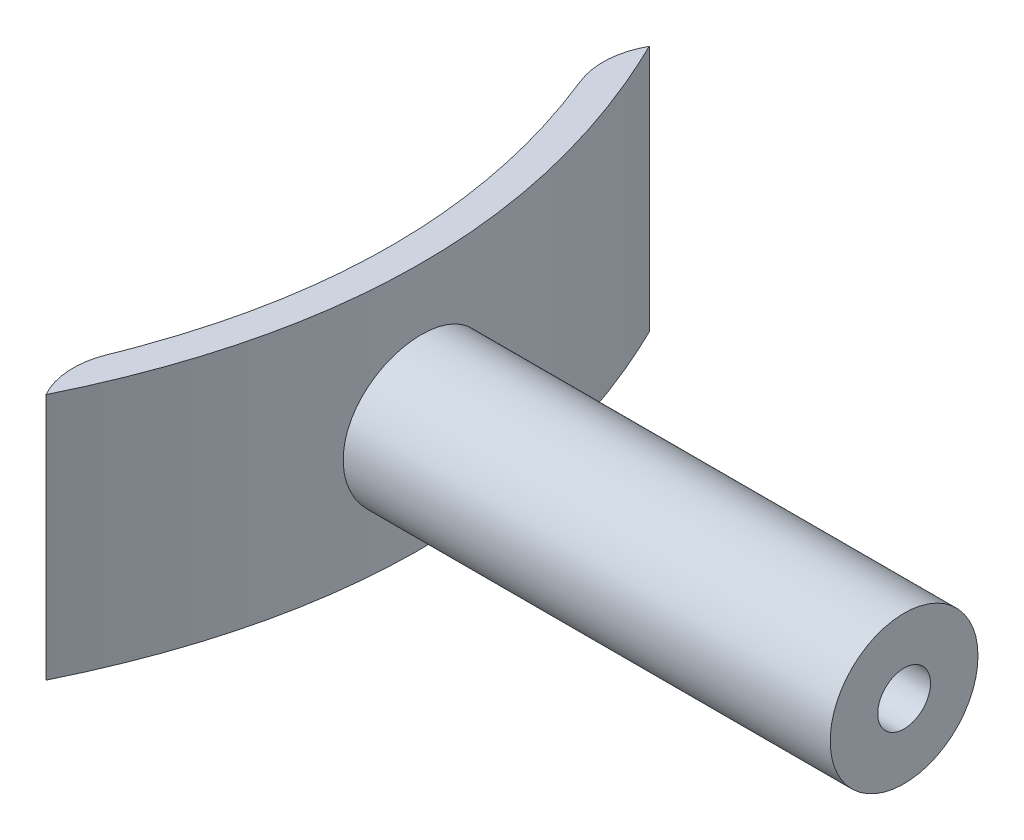
ISO-10303-21;
HEADER;
FILE_DESCRIPTION(('STEP AP214'),'2;1');
FILE_NAME('part.step','',(''),(''),'','','');
FILE_SCHEMA(('AUTOMOTIVE_DESIGN { 1 0 10303 214 1 1 1 1 }'));
ENDSEC;
DATA;
#1=APPLICATION_CONTEXT('core data for automotive mechanical design processes');
#2=APPLICATION_PROTOCOL_DEFINITION('international standard','automotive_design',2000,#1);
#3=PRODUCT_CONTEXT('',#1,'mechanical');
#4=PRODUCT('Part','Part','',(#3));
#5=PRODUCT_RELATED_PRODUCT_CATEGORY('part','',(#4));
#6=PRODUCT_DEFINITION_FORMATION('','',#4);
#7=PRODUCT_DEFINITION_CONTEXT('part definition',#1,'design');
#8=PRODUCT_DEFINITION('design','',#6,#7);
#9=PRODUCT_DEFINITION_SHAPE('','',#8);
#10=(LENGTH_UNIT() NAMED_UNIT(*) SI_UNIT(.MILLI.,.METRE.));
#11=(NAMED_UNIT(*) PLANE_ANGLE_UNIT() SI_UNIT($,.RADIAN.));
#12=(NAMED_UNIT(*) SI_UNIT($,.STERADIAN.) SOLID_ANGLE_UNIT());
#13=UNCERTAINTY_MEASURE_WITH_UNIT(LENGTH_MEASURE(1.E-05),#10,'distance_accuracy_value','');
#14=(GEOMETRIC_REPRESENTATION_CONTEXT(3) GLOBAL_UNCERTAINTY_ASSIGNED_CONTEXT((#13)) GLOBAL_UNIT_ASSIGNED_CONTEXT((#10,
#11,#12)) REPRESENTATION_CONTEXT('',''));
#15=CARTESIAN_POINT('',(0.,0.,0.));
#16=DIRECTION('',(0.,0.,1.));
#17=DIRECTION('',(1.,0.,0.));
#18=AXIS2_PLACEMENT_3D('',#15,#16,#17);
#19=CARTESIAN_POINT('',(8.30578993953427,18.,-19.120521249849));
#20=CARTESIAN_POINT('',(8.69432640668797,18.,-18.3272698292218));
#21=CARTESIAN_POINT('',(9.43893120807307,18.,-16.7065871316813));
#22=CARTESIAN_POINT('',(10.7095495121885,18.,-13.5117319179102));
#23=CARTESIAN_POINT('',(11.9315463906869,18.,-9.52029759230653));
#24=CARTESIAN_POINT('',(12.8058782508262,18.,-4.75550751856063));
#25=CARTESIAN_POINT('',(13.0970531420327,18.,-0.000126230612995312));
#26=CARTESIAN_POINT('',(12.8059091798109,18.,4.75525475600666));
#27=CARTESIAN_POINT('',(11.9316084420175,18.,9.52004401095573));
#28=CARTESIAN_POINT('',(10.7096378351998,18.,13.5114773120333));
#29=CARTESIAN_POINT('',(9.43904062997395,18.,16.7063317055223));
#30=CARTESIAN_POINT('',(8.69444663869911,18.,18.3270138238306));
#31=CARTESIAN_POINT('',(8.30591540031059,18.,19.1202651022154));
#32=B_SPLINE_CURVE_WITH_KNOTS('',3,(#19,#20,#21,#22,#23,#24,#25,#26,#27,#28,#29,#30,#31),
.UNSPECIFIED.,.F.,.F.,(4,1,1,1,1,1,1,1,1,1,4),(0.214281920444454,0.249996443273626,
0.285710966102797,0.35714001176114,0.428569057419482,0.499998103077825,0.571427148736168,
0.64285619439451,0.714285240052853,0.749999762882024,0.785714285711196),.UNSPECIFIED.);
#33=DIRECTION('',(0.,-1.,0.));
#34=VECTOR('',#33,1.);
#35=SURFACE_OF_LINEAR_EXTRUSION('',#32,#34);
#36=CARTESIAN_POINT('',(9.83262096336921,18.,-15.6998995939076));
#37=VERTEX_POINT('',#36);
#38=CARTESIAN_POINT('',(9.83272685698644,18.,15.6996366868571));
#39=VERTEX_POINT('',#38);
#40=EDGE_CURVE('E99',#37,#39,#32,.T.);
#41=ORIENTED_EDGE('',*,*,#40,.F.);
#42=DIRECTION('',(0.,-1.,0.));
#43=VECTOR('',#42,1.);
#44=CARTESIAN_POINT('',(9.83262096336921,18.,-15.6998995939077));
#45=LINE('',#44,#43);
#46=CARTESIAN_POINT('',(9.83262096336921,1.6,-15.6998995939076));
#47=VERTEX_POINT('',#46);
#48=EDGE_CURVE('E107',#37,#47,#45,.T.);
#49=ORIENTED_EDGE('',*,*,#48,.T.);
#50=CARTESIAN_POINT('',(8.30578993953427,1.6,-19.120521249849));
#51=CARTESIAN_POINT('',(8.69432640668797,1.6,-18.3272698292218));
#52=CARTESIAN_POINT('',(9.43893120807307,1.6,-16.7065871316813));
#53=CARTESIAN_POINT('',(10.7095495121885,1.6,-13.5117319179102));
#54=CARTESIAN_POINT('',(11.9315463906869,1.6,-9.52029759230653));
#55=CARTESIAN_POINT('',(12.8058782508262,1.6,-4.75550751856063));
#56=CARTESIAN_POINT('',(13.0970531420327,1.6,-0.000126230612995312));
#57=CARTESIAN_POINT('',(12.8059091798109,1.6,4.75525475600666));
#58=CARTESIAN_POINT('',(11.9316084420175,1.6,9.52004401095573));
#59=CARTESIAN_POINT('',(10.7096378351998,1.6,13.5114773120333));
#60=CARTESIAN_POINT('',(9.43904062997395,1.6,16.7063317055223));
#61=CARTESIAN_POINT('',(8.69444663869911,1.6,18.3270138238306));
#62=CARTESIAN_POINT('',(8.30591540031059,1.6,19.1202651022154));
#63=B_SPLINE_CURVE_WITH_KNOTS('',3,(#50,#51,#52,#53,#54,#55,#56,#57,#58,#59,#60,#61,#62),
.UNSPECIFIED.,.F.,.F.,(4,1,1,1,1,1,1,1,1,1,4),(0.214281920444454,0.249996443273626,
0.285710966102797,0.35714001176114,0.428569057419482,0.499998103077825,0.571427148736168,
0.64285619439451,0.714285240052853,0.749999762882024,0.785714285711196),.UNSPECIFIED.);
#64=CARTESIAN_POINT('',(9.83272685698644,1.6,15.6996366868571));
#65=VERTEX_POINT('',#64);
#66=EDGE_CURVE('E80',#47,#65,#63,.T.);
#67=ORIENTED_EDGE('',*,*,#66,.T.);
#68=DIRECTION('',(0.,-1.,0.));
#69=VECTOR('',#68,1.);
#70=CARTESIAN_POINT('',(9.83272685698644,1.6,15.6996366868571));
#71=LINE('',#70,#69);
#72=EDGE_CURVE('E50',#65,#39,#71,.F.);
#73=ORIENTED_EDGE('',*,*,#72,.T.);
#74=EDGE_LOOP('',(#41,#49,#67,#73));
#75=FACE_BOUND('',#74,.T.);
#76=ADVANCED_FACE('F35',(#75),#35,.F.);
#77=CARTESIAN_POINT('',(10.1020408162886,18.,19.9999999998282));
#78=CARTESIAN_POINT('',(13.3673469386676,18.,13.333333333235));
#79=CARTESIAN_POINT('',(16.6326747403413,18.,-8.85231190403822E-05));
#80=CARTESIAN_POINT('',(13.3673035803619,18.,-13.3335103791362));
#81=CARTESIAN_POINT('',(10.1019107409655,18.,-20.0002655687656));
#82=B_SPLINE_CURVE_WITH_KNOTS('',3,(#77,#78,#79,#80,#81),.UNSPECIFIED.,.F.,.F.,(4,1,4),
(0.214281920444454,0.49999620615565,0.785714285711196),.UNSPECIFIED.);
#83=DIRECTION('',(0.,-1.,0.));
#84=VECTOR('',#83,1.);
#85=SURFACE_OF_LINEAR_EXTRUSION('',#82,#84);
#86=CARTESIAN_POINT('',(14.7060000000272,9.,-4.9));
#87=CARTESIAN_POINT('',(14.7059995049305,9.13713893623871,-4.9000015196508));
#88=CARTESIAN_POINT('',(14.7066922575911,9.27425536448456,-4.89424064369801));
#89=CARTESIAN_POINT('',(14.7094426445366,9.54755199242584,-4.8712410477495));
#90=CARTESIAN_POINT('',(14.7115005924742,9.68373196970612,-4.85399969011672));
#91=CARTESIAN_POINT('',(14.7169256465479,9.9542400641125,-4.80814539424531));
#92=CARTESIAN_POINT('',(14.7202937441309,10.0885666988314,-4.77952384375756));
#93=CARTESIAN_POINT('',(14.7282443740937,10.354360364088,-4.71110876778069));
#94=CARTESIAN_POINT('',(14.7328273512242,10.4858263282625,-4.67131115057031));
#95=CARTESIAN_POINT('',(14.7430716392084,10.7447827642079,-4.58088669160732));
#96=CARTESIAN_POINT('',(14.748731830993,10.8722772032611,-4.53027108151711));
#97=CARTESIAN_POINT('',(14.7609758718219,11.1225850955331,-4.41853192314359));
#98=CARTESIAN_POINT('',(14.767560060879,11.2453968043466,-4.35740450484522));
#99=CARTESIAN_POINT('',(14.7814610954898,11.4853665801815,-4.22512879280006));
#100=CARTESIAN_POINT('',(14.788777533668,11.6025277376226,-4.1539860620562));
#101=CARTESIAN_POINT('',(14.8039435977111,11.8304994835718,-4.00212914166878));
#102=CARTESIAN_POINT('',(14.8117934204182,11.9413076994437,-3.92141141014211));
#103=CARTESIAN_POINT('',(14.8278374594419,12.1562090567325,-3.75063458392804));
#104=CARTESIAN_POINT('',(14.8360329779644,12.2602721986445,-3.66053785901718));
#105=CARTESIAN_POINT('',(14.8525094668381,12.4604866359568,-3.47188113384696));
#106=CARTESIAN_POINT('',(14.860790467668,12.5566349913903,-3.37331801625748));
#107=CARTESIAN_POINT('',(14.8771987395356,12.7402755764929,-3.1684780800964));
#108=CARTESIAN_POINT('',(14.8853260587005,12.8277705536281,-3.06220372855731));
#109=CARTESIAN_POINT('',(14.9012033200121,12.9935549000475,-2.84261363951248));
#110=CARTESIAN_POINT('',(14.9089531218334,13.0718408613556,-2.72929531881153));
#111=CARTESIAN_POINT('',(14.9238729330863,13.2188118482155,-2.49613076757728));
#112=CARTESIAN_POINT('',(14.9310413301199,13.2874705343376,-2.37626782858946));
#113=CARTESIAN_POINT('',(14.9445731619271,13.4144660526773,-2.13109277805821));
#114=CARTESIAN_POINT('',(14.9509362971326,13.4727990468015,-2.00577866176505));
#115=CARTESIAN_POINT('',(14.9626698853316,13.5786654643483,-1.75068113534849));
#116=CARTESIAN_POINT('',(14.9680407314266,13.6262031661121,-1.62089951933024));
#117=CARTESIAN_POINT('',(14.9776405474154,13.7101741938207,-1.3577004534552));
#118=CARTESIAN_POINT('',(14.9818690976188,13.7466034390447,-1.22428168704158));
#119=CARTESIAN_POINT('',(14.9890405139449,13.8079017711421,-0.955496009597774));
#120=CARTESIAN_POINT('',(14.9919899058228,13.8328295764193,-0.820142714628787));
#121=CARTESIAN_POINT('',(14.9965536076366,13.8712300813015,-0.54778498247782));
#122=CARTESIAN_POINT('',(14.9981674249206,13.8846985539663,-0.410779954912282));
#123=CARTESIAN_POINT('',(15.0009177788013,13.9076902468754,0.00112867067006514));
#124=CARTESIAN_POINT('',(14.9999714958244,13.8998687462605,0.277229555266553));
#125=CARTESIAN_POINT('',(14.9926230607725,13.8382237345525,0.822568437568239));
#126=CARTESIAN_POINT('',(14.9862490840685,13.7846377843044,1.09183449486941));
#127=CARTESIAN_POINT('',(14.96880696971,13.63338512143,1.61756480118088));
#128=CARTESIAN_POINT('',(14.957738746398,13.5357176044309,1.8740288164927));
#129=CARTESIAN_POINT('',(14.9321116158252,13.2988108051989,2.36756384995115));
#130=CARTESIAN_POINT('',(14.9175440364583,13.1594680296991,2.60458469499461));
#131=CARTESIAN_POINT('',(14.8865583043378,12.8432429066782,3.05197058793648));
#132=CARTESIAN_POINT('',(14.8701400738964,12.6663589829507,3.26233451602254));
#133=CARTESIAN_POINT('',(14.8371731989668,12.2787473221972,3.65181773494414));
#134=CARTESIAN_POINT('',(14.8206243835626,12.0678137823805,3.83073225619235));
#135=CARTESIAN_POINT('',(14.7893607738264,11.6187999479322,4.1506475920678));
#136=CARTESIAN_POINT('',(14.7746459836398,11.3807195919439,4.29164832100058));
#137=CARTESIAN_POINT('',(14.748708358801,10.884005006542,4.53173674962589));
#138=CARTESIAN_POINT('',(14.737486680619,10.6253640055843,4.63081057240445));
#139=CARTESIAN_POINT('',(14.7198202034065,10.0949529629989,4.78406465730944));
#140=CARTESIAN_POINT('',(14.713375196642,9.82318349286627,4.83824687175146));
#141=CARTESIAN_POINT('',(14.7060222026645,9.27601845171383,4.8999130128696));
#142=CARTESIAN_POINT('',(14.7050804283771,9.00065543234614,4.90768190059369));
#143=CARTESIAN_POINT('',(14.7087500772725,8.45255155086009,4.87705199445301));
#144=CARTESIAN_POINT('',(14.7133613925539,8.17981063789566,4.83865409764988));
#145=CARTESIAN_POINT('',(14.7275923968207,7.64553552643175,4.71701863402924));
#146=CARTESIAN_POINT('',(14.7371968640587,7.38396986793272,4.63391732008584));
#147=CARTESIAN_POINT('',(14.7603290063253,6.87848742150351,4.42537484250137));
#148=CARTESIAN_POINT('',(14.7738568065073,6.63457119689667,4.29993232816421));
#149=CARTESIAN_POINT('',(14.8034015111668,6.17002757874579,4.00956872881103));
#150=CARTESIAN_POINT('',(14.8194300245684,5.94951729710461,3.84446147642272));
#151=CARTESIAN_POINT('',(14.8521392910723,5.53923692567772,3.4797230126142));
#152=CARTESIAN_POINT('',(14.8688200675711,5.3494679398274,3.28009056190881));
#153=CARTESIAN_POINT('',(14.9010574153223,5.00505470808568,2.85070692752245));
#154=CARTESIAN_POINT('',(14.916607692567,4.85059815906725,2.62080458732964));
#155=CARTESIAN_POINT('',(14.9447305357582,4.58249396057102,2.13819629181196));
#156=CARTESIAN_POINT('',(14.9573031574932,4.46884554650354,1.88549076384336));
#157=CARTESIAN_POINT('',(14.9780138396956,4.28587949792973,1.36487722254712));
#158=CARTESIAN_POINT('',(14.9861627352918,4.21645347551305,1.09700814485232));
#159=CARTESIAN_POINT('',(14.9944068616771,4.14678824277509,0.689515400127947));
#160=CARTESIAN_POINT('',(14.9964917487187,4.12931202556462,0.552663072126941));
#161=CARTESIAN_POINT('',(14.9992840332716,4.10595324317984,0.277972620516789));
#162=CARTESIAN_POINT('',(14.9999919488933,4.10006631731541,0.140134887285574));
#163=CARTESIAN_POINT('',(15.0000078742794,4.09993515165227,-0.134718973371336));
#164=CARTESIAN_POINT('',(14.9993241531812,4.10562213936996,-0.271735130195881));
#165=CARTESIAN_POINT('',(14.9965943539676,4.12844952966668,-0.544747471970712));
#166=CARTESIAN_POINT('',(14.9945487828928,4.14558566953379,-0.680744017490213));
#167=CARTESIAN_POINT('',(14.989152703405,4.19118974311012,-0.950847407360051));
#168=CARTESIAN_POINT('',(14.9858017197918,4.21966180343812,-1.08495354511695));
#169=CARTESIAN_POINT('',(14.9778914919797,4.28771520530778,-1.35022791599571));
#170=CARTESIAN_POINT('',(14.9733326879066,4.32729250044807,-1.481397200453));
#171=CARTESIAN_POINT('',(14.9631348541579,4.41727493987943,-1.73993298030312));
#172=CARTESIAN_POINT('',(14.9574957573941,4.46768075666636,-1.86729923895254));
#173=CARTESIAN_POINT('',(14.9452986902682,4.57893479301101,-2.11728441396391));
#174=CARTESIAN_POINT('',(14.9387410541602,4.63977921578898,-2.23990503662635));
#175=CARTESIAN_POINT('',(14.9248868644164,4.77151346813194,-2.47964013650598));
#176=CARTESIAN_POINT('',(14.9175900426785,4.84240694623066,-2.59675259320183));
#177=CARTESIAN_POINT('',(14.9024664719909,4.99369504329533,-2.82457282378166));
#178=CARTESIAN_POINT('',(14.8946399145918,5.07408623567597,-2.93528288617992));
#179=CARTESIAN_POINT('',(14.8786215766626,5.24437460683065,-3.15027024718917));
#180=CARTESIAN_POINT('',(14.8704277742271,5.33432949277176,-3.25450169164386));
#181=CARTESIAN_POINT('',(14.8539563792441,5.52264978331688,-3.45498822489464));
#182=CARTESIAN_POINT('',(14.8456788182009,5.62101212220482,-3.55124619616058));
#183=CARTESIAN_POINT('',(14.8292652475448,5.82555131889055,-3.73521174135161));
#184=CARTESIAN_POINT('',(14.8211293266333,5.93173287014792,-3.82291410516286));
#185=CARTESIAN_POINT('',(14.8052368602263,6.15107659310522,-3.98905467065213));
#186=CARTESIAN_POINT('',(14.7974801757283,6.26423617221398,-4.06749628184145));
#187=CARTESIAN_POINT('',(14.7825331390389,6.49723589357266,-4.21488413478058));
#188=CARTESIAN_POINT('',(14.7753451116375,6.61710035142392,-4.28379218188846));
#189=CARTESIAN_POINT('',(14.761777000058,6.86221258025977,-4.41122871701214));
#190=CARTESIAN_POINT('',(14.7553966198298,6.98745835599496,-4.46976101151838));
#191=CARTESIAN_POINT('',(14.7436281837287,7.24238896013945,-4.57600864930192));
#192=CARTESIAN_POINT('',(14.7382393447486,7.37207018864548,-4.62373253586541));
#193=CARTESIAN_POINT('',(14.7286034719666,7.6349947888203,-4.70805935791488));
#194=CARTESIAN_POINT('',(14.7243561661523,7.76823730354686,-4.74466494301628));
#195=CARTESIAN_POINT('',(14.7159130534915,8.08250393387247,-4.81686303737225));
#196=CARTESIAN_POINT('',(14.7122111865154,8.26458126018365,-4.84800780629593));
#197=CARTESIAN_POINT('',(14.7072550007643,8.63111930265135,-4.88957519735995));
#198=CARTESIAN_POINT('',(14.7060006658171,8.81558000305141,-4.89999795642287));
#199=CARTESIAN_POINT('',(14.7060000000272,9.,-4.9));
#200=B_SPLINE_CURVE_WITH_KNOTS('',3,(#86,#87,#88,#89,#90,#91,#92,#93,#94,#95,#96,#97,#98,#99,
#100,#101,#102,#103,#104,#105,#106,#107,#108,#109,#110,#111,#112,#113,#114,#115,#116,#117,#118,
#119,#120,#121,#122,#123,#124,#125,#126,#127,#128,#129,#130,#131,#132,#133,#134,#135,#136,#137,
#138,#139,#140,#141,#142,#143,#144,#145,#146,#147,#148,#149,#150,#151,#152,#153,#154,#155,#156,
#157,#158,#159,#160,#161,#162,#163,#164,#165,#166,#167,#168,#169,#170,#171,#172,#173,#174,#175,
#176,#177,#178,#179,#180,#181,#182,#183,#184,#185,#186,#187,#188,#189,#190,#191,#192,#193,#194,
#195,#196,#197,#198,#199),.UNSPECIFIED.,.T.,.F.,(4,2,2,2,2,2,2,2,2,2,2,2,2,2,2,2,2,2,2,2,2,2,2,
2,2,2,2,2,2,2,2,2,2,2,2,2,2,2,2,2,2,2,2,2,2,2,2,2,2,2,2,2,2,2,2,2,4),(0.,0.411255439428272,
0.822605397280921,1.23426724894534,1.64608001295823,2.05746727603794,2.46900632049858,
2.88031767105555,3.29178164681654,3.70496524089564,4.11830162691254,4.53150635358176,
4.94486351684558,5.35933040121226,5.77395102223229,6.18840703479419,6.60301511595282,
7.01548241303088,7.42810178874477,8.25241766928661,9.0724803979506,9.89255809121102,
10.714689457508,11.5368553487228,12.3641906731345,13.1915278675113,14.0191386791382,
14.8467134964584,15.6692020387127,16.4916745995424,17.3116544089142,18.131660378343,
18.9555929592071,19.7795551213483,20.6078000404158,21.4360294405048,22.2622209809898,
22.6757504808534,23.0891243526566,23.5000491188275,23.9108209759897,24.3217425034859,
24.732514497983,25.1433120104935,25.5539604213186,25.9647583109284,26.3754084428836,
26.7886945692361,27.2018306315449,27.6152167312942,28.0284501577922,28.4432939518931,
28.8579852383286,29.2723475874976,29.6866111118725,30.2396577528479,30.7927007395052),.UNSPECIFIED.);
#201=CARTESIAN_POINT('',(14.7060000000272,9.,-4.9));
#202=VERTEX_POINT('',#201);
#203=EDGE_CURVE('E130',#202,#202,#200,.T.);
#204=ORIENTED_EDGE('',*,*,#203,.F.);
#205=EDGE_LOOP('',(#204));
#206=FACE_BOUND('',#205,.T.);
#207=DIRECTION('',(0.,-1.,0.));
#208=VECTOR('',#207,1.);
#209=CARTESIAN_POINT('',(10.1020408162886,18.,19.9999999998282));
#210=LINE('',#209,#208);
#211=CARTESIAN_POINT('',(10.1020408162886,18.,19.9999999998282));
#212=VERTEX_POINT('',#211);
#213=CARTESIAN_POINT('',(10.1020408162886,1.6,19.9999999998282));
#214=VERTEX_POINT('',#213);
#215=EDGE_CURVE('E93',#212,#214,#210,.T.);
#216=ORIENTED_EDGE('',*,*,#215,.T.);
#217=CARTESIAN_POINT('',(10.1020408162886,1.6,19.9999999998282));
#218=CARTESIAN_POINT('',(13.3673469386676,1.6,13.333333333235));
#219=CARTESIAN_POINT('',(16.6326747403413,1.6,-8.85231190403822E-05));
#220=CARTESIAN_POINT('',(13.3673035803619,1.6,-13.3335103791362));
#221=CARTESIAN_POINT('',(10.1019107409655,1.6,-20.0002655687656));
#222=B_SPLINE_CURVE_WITH_KNOTS('',3,(#217,#218,#219,#220,#221),.UNSPECIFIED.,.F.,.F.,(4,1,4),
(0.214281920444454,0.49999620615565,0.785714285711196),.UNSPECIFIED.);
#223=CARTESIAN_POINT('',(10.1019107409655,1.6,-20.0002655687656));
#224=VERTEX_POINT('',#223);
#225=EDGE_CURVE('E78',#214,#224,#222,.T.);
#226=ORIENTED_EDGE('',*,*,#225,.T.);
#227=DIRECTION('',(0.,-1.,0.));
#228=VECTOR('',#227,1.);
#229=CARTESIAN_POINT('',(10.1019107409655,18.,-20.0002655687656));
#230=LINE('',#229,#228);
#231=CARTESIAN_POINT('',(10.1019107409655,18.,-20.0002655687656));
#232=VERTEX_POINT('',#231);
#233=EDGE_CURVE('E91',#232,#224,#230,.T.);
#234=ORIENTED_EDGE('',*,*,#233,.F.);
#235=EDGE_CURVE('E96',#212,#232,#82,.T.);
#236=ORIENTED_EDGE('',*,*,#235,.F.);
#237=EDGE_LOOP('',(#216,#226,#234,#236));
#238=FACE_BOUND('',#237,.T.);
#239=ADVANCED_FACE('F89',(#206,#238),#85,.F.);
#240=CARTESIAN_POINT('',(12.9999999997947,18.,-0.000126280834325011));
#241=DIRECTION('',(0.,1.,0.));
#242=DIRECTION('',(0.,0.,1.));
#243=AXIS2_PLACEMENT_3D('',#240,#241,#242);
#244=PLANE('',#243);
#245=ORIENTED_EDGE('',*,*,#235,.T.);
#246=CARTESIAN_POINT('',(14.4704940048939,18.,-17.5680895335814));
#247=DIRECTION('',(0.,1.,0.));
#248=DIRECTION('',(0.,0.,1.));
#249=AXIS2_PLACEMENT_3D('',#246,#247,#248);
#250=CIRCLE('',#249,5.);
#251=EDGE_CURVE('E11',#232,#37,#250,.T.);
#252=ORIENTED_EDGE('',*,*,#251,.T.);
#253=ORIENTED_EDGE('',*,*,#40,.T.);
#254=CARTESIAN_POINT('',(14.4706106717967,18.,17.5677998810991));
#255=DIRECTION('',(0.,1.,0.));
#256=DIRECTION('',(0.,0.,1.));
#257=AXIS2_PLACEMENT_3D('',#254,#255,#256);
#258=CIRCLE('',#257,5.);
#259=EDGE_CURVE('E43',#39,#212,#258,.T.);
#260=ORIENTED_EDGE('',*,*,#259,.T.);
#261=EDGE_LOOP('',(#245,#252,#253,#260));
#262=FACE_BOUND('',#261,.T.);
#263=ADVANCED_FACE('F110',(#262),#244,.T.);
#264=CARTESIAN_POINT('',(8.30478993953427,9.,0.));
#265=DIRECTION('',(1.,0.,0.));
#266=DIRECTION('',(0.,0.,-1.));
#267=AXIS2_PLACEMENT_3D('',#264,#265,#266);
#268=CYLINDRICAL_SURFACE('',#267,4.9);
#269=ORIENTED_EDGE('',*,*,#203,.T.);
#270=EDGE_LOOP('',(#269));
#271=FACE_BOUND('',#270,.T.);
#272=CARTESIAN_POINT('',(47.,9.,0.));
#273=DIRECTION('',(1.,0.,0.));
#274=DIRECTION('',(0.,0.,-1.));
#275=AXIS2_PLACEMENT_3D('',#272,#273,#274);
#276=CIRCLE('',#275,4.9);
#277=CARTESIAN_POINT('',(47.,9.,-4.9));
#278=VERTEX_POINT('',#277);
#279=EDGE_CURVE('E126',#278,#278,#276,.T.);
#280=ORIENTED_EDGE('',*,*,#279,.F.);
#281=EDGE_LOOP('',(#280));
#282=FACE_BOUND('',#281,.T.);
#283=ADVANCED_FACE('F147',(#271,#282),#268,.T.);
#284=CARTESIAN_POINT('',(47.,9.,0.));
#285=DIRECTION('',(1.,0.,0.));
#286=DIRECTION('',(0.,0.,-1.));
#287=AXIS2_PLACEMENT_3D('',#284,#285,#286);
#288=PLANE('',#287);
#289=CARTESIAN_POINT('',(47.,9.,0.));
#290=DIRECTION('',(1.,0.,0.));
#291=DIRECTION('',(0.,0.,-1.));
#292=AXIS2_PLACEMENT_3D('',#289,#290,#291);
#293=CIRCLE('',#292,1.75);
#294=CARTESIAN_POINT('',(47.,9.,-1.75));
#295=VERTEX_POINT('',#294);
#296=EDGE_CURVE('E112',#295,#295,#293,.T.);
#297=ORIENTED_EDGE('',*,*,#296,.F.);
#298=EDGE_LOOP('',(#297));
#299=FACE_BOUND('',#298,.T.);
#300=ORIENTED_EDGE('',*,*,#279,.T.);
#301=EDGE_LOOP('',(#300));
#302=FACE_BOUND('',#301,.T.);
#303=ADVANCED_FACE('F145',(#299,#302),#288,.T.);
#304=CARTESIAN_POINT('',(18.,9.,0.));
#305=DIRECTION('',(1.,0.,0.));
#306=DIRECTION('',(0.,0.,-1.));
#307=AXIS2_PLACEMENT_3D('',#304,#305,#306);
#308=CYLINDRICAL_SURFACE('',#307,1.75);
#309=CARTESIAN_POINT('',(18.,9.,0.));
#310=DIRECTION('',(1.,0.,0.));
#311=DIRECTION('',(0.,0.,-1.));
#312=AXIS2_PLACEMENT_3D('',#309,#310,#311);
#313=CIRCLE('',#312,1.75);
#314=CARTESIAN_POINT('',(18.,9.,-1.75));
#315=VERTEX_POINT('',#314);
#316=EDGE_CURVE('E115',#315,#315,#313,.T.);
#317=CARTESIAN_POINT('',(18.,9.,-1.75));
#318=CARTESIAN_POINT('',(18.3020833333333,9.,-1.75));
#319=CARTESIAN_POINT('',(18.6041666666667,9.,-1.75));
#320=CARTESIAN_POINT('',(19.2083333333333,9.,-1.75));
#321=CARTESIAN_POINT('',(19.5104166666667,9.,-1.75));
#322=CARTESIAN_POINT('',(20.1145833333333,9.,-1.75));
#323=CARTESIAN_POINT('',(20.4166666666667,9.,-1.75));
#324=CARTESIAN_POINT('',(21.0208333333333,9.,-1.75));
#325=CARTESIAN_POINT('',(21.3229166666667,9.,-1.75));
#326=CARTESIAN_POINT('',(21.9270833333333,9.,-1.75));
#327=CARTESIAN_POINT('',(22.2291666666667,9.,-1.75));
#328=CARTESIAN_POINT('',(22.8333333333333,9.,-1.75));
#329=CARTESIAN_POINT('',(23.1354166666667,9.,-1.75));
#330=CARTESIAN_POINT('',(23.7395833333333,9.,-1.75));
#331=CARTESIAN_POINT('',(24.0416666666667,9.,-1.75));
#332=CARTESIAN_POINT('',(24.6458333333333,9.,-1.75));
#333=CARTESIAN_POINT('',(24.9479166666667,9.,-1.75));
#334=CARTESIAN_POINT('',(25.5520833333333,9.,-1.75));
#335=CARTESIAN_POINT('',(25.8541666666667,9.,-1.75));
#336=CARTESIAN_POINT('',(26.4583333333333,9.,-1.75));
#337=CARTESIAN_POINT('',(26.7604166666667,9.,-1.75));
#338=CARTESIAN_POINT('',(27.3645833333333,9.,-1.75));
#339=CARTESIAN_POINT('',(27.6666666666667,9.,-1.75));
#340=CARTESIAN_POINT('',(28.2708333333333,9.,-1.75));
#341=CARTESIAN_POINT('',(28.5729166666667,9.,-1.75));
#342=CARTESIAN_POINT('',(29.1770833333333,9.,-1.75));
#343=CARTESIAN_POINT('',(29.4791666666667,9.,-1.75));
#344=CARTESIAN_POINT('',(30.0833333333333,9.,-1.75));
#345=CARTESIAN_POINT('',(30.3854166666667,9.,-1.75));
#346=CARTESIAN_POINT('',(30.9895833333333,9.,-1.75));
#347=CARTESIAN_POINT('',(31.2916666666667,9.,-1.75));
#348=CARTESIAN_POINT('',(31.8958333333333,9.,-1.75));
#349=CARTESIAN_POINT('',(32.1979166666667,9.,-1.75));
#350=CARTESIAN_POINT('',(32.8020833333333,9.,-1.75));
#351=CARTESIAN_POINT('',(33.1041666666667,9.,-1.75));
#352=CARTESIAN_POINT('',(33.7083333333333,9.,-1.75));
#353=CARTESIAN_POINT('',(34.0104166666667,9.,-1.75));
#354=CARTESIAN_POINT('',(34.6145833333333,9.,-1.75));
#355=CARTESIAN_POINT('',(34.9166666666667,9.,-1.75));
#356=CARTESIAN_POINT('',(35.5208333333333,9.,-1.75));
#357=CARTESIAN_POINT('',(35.8229166666667,9.,-1.75));
#358=CARTESIAN_POINT('',(36.4270833333333,9.,-1.75));
#359=CARTESIAN_POINT('',(36.7291666666667,9.,-1.75));
#360=CARTESIAN_POINT('',(37.3333333333333,9.,-1.75));
#361=CARTESIAN_POINT('',(37.6354166666667,9.,-1.75));
#362=CARTESIAN_POINT('',(38.2395833333333,9.,-1.75));
#363=CARTESIAN_POINT('',(38.5416666666667,9.,-1.75));
#364=CARTESIAN_POINT('',(39.1458333333333,9.,-1.75));
#365=CARTESIAN_POINT('',(39.4479166666667,9.,-1.75));
#366=CARTESIAN_POINT('',(40.0520833333333,9.,-1.75));
#367=CARTESIAN_POINT('',(40.3541666666667,9.,-1.75));
#368=CARTESIAN_POINT('',(40.9583333333333,9.,-1.75));
#369=CARTESIAN_POINT('',(41.2604166666667,9.,-1.75));
#370=CARTESIAN_POINT('',(41.8645833333333,9.,-1.75));
#371=CARTESIAN_POINT('',(42.1666666666667,9.,-1.75));
#372=CARTESIAN_POINT('',(42.7708333333333,9.,-1.75));
#373=CARTESIAN_POINT('',(43.0729166666667,9.,-1.75));
#374=CARTESIAN_POINT('',(43.6770833333333,9.,-1.75));
#375=CARTESIAN_POINT('',(43.9791666666667,9.,-1.75));
#376=CARTESIAN_POINT('',(44.5833333333333,9.,-1.75));
#377=CARTESIAN_POINT('',(44.8854166666667,9.,-1.75));
#378=CARTESIAN_POINT('',(45.4895833333333,9.,-1.75));
#379=CARTESIAN_POINT('',(45.7916666666667,9.,-1.75));
#380=CARTESIAN_POINT('',(46.3958333333333,9.,-1.75));
#381=CARTESIAN_POINT('',(46.6979166666667,9.,-1.75));
#382=CARTESIAN_POINT('',(47.,9.,-1.75));
#383=B_SPLINE_CURVE_WITH_KNOTS('',3,(#317,#318,#319,#320,#321,#322,#323,#324,#325,#326,#327,
#328,#329,#330,#331,#332,#333,#334,#335,#336,#337,#338,#339,#340,#341,#342,#343,#344,#345,#346,
#347,#348,#349,#350,#351,#352,#353,#354,#355,#356,#357,#358,#359,#360,#361,#362,#363,#364,#365,
#366,#367,#368,#369,#370,#371,#372,#373,#374,#375,#376,#377,#378,#379,#380,#381,#382),
.UNSPECIFIED.,.F.,.F.,(4,2,2,2,2,2,2,2,2,2,2,2,2,2,2,2,2,2,2,2,2,2,2,2,2,2,2,2,2,2,2,2,4),(0.,
0.906249999999997,1.8125,2.71875,3.625,4.53125,5.4375,6.34375,7.25,8.15625,9.0625,
9.96874999999999,10.875,11.78125,12.6875,13.59375,14.5,15.40625,16.3125,17.21875,18.125,
19.03125,19.9375,20.84375,21.75,22.65625,23.5625,24.46875,25.375,26.28125,27.1875,28.09375,29.),.UNSPECIFIED.);
#384=EDGE_CURVE('BSEAM170',#315,#295,#383,.T.);
#385=ORIENTED_EDGE('',*,*,#316,.F.);
#386=ORIENTED_EDGE('',*,*,#296,.T.);
#387=ORIENTED_EDGE('',*,*,#384,.T.);
#388=ORIENTED_EDGE('',*,*,#384,.F.);
#389=EDGE_LOOP('',(#385,#387,#386,#388));
#390=FACE_BOUND('',#389,.T.);
#391=ADVANCED_FACE('F170',(#390),#308,.F.);
#392=CARTESIAN_POINT('',(18.,9.,0.));
#393=DIRECTION('',(1.,0.,0.));
#394=DIRECTION('',(0.,0.,-1.));
#395=AXIS2_PLACEMENT_3D('',#392,#393,#394);
#396=PLANE('',#395);
#397=ORIENTED_EDGE('',*,*,#316,.T.);
#398=EDGE_LOOP('',(#397));
#399=FACE_BOUND('',#398,.T.);
#400=ADVANCED_FACE('F175',(#399),#396,.T.);
#401=CARTESIAN_POINT('',(6.99999999999999,1.6,19.9999999998282));
#402=DIRECTION('',(0.,1.,0.));
#403=DIRECTION('',(0.,0.,1.));
#404=AXIS2_PLACEMENT_3D('',#401,#402,#403);
#405=PLANE('',#404);
#406=ORIENTED_EDGE('',*,*,#66,.F.);
#407=CARTESIAN_POINT('',(14.4704940048939,1.6,-17.5680895335814));
#408=DIRECTION('',(0.,1.,0.));
#409=DIRECTION('',(0.,0.,1.));
#410=AXIS2_PLACEMENT_3D('',#407,#408,#409);
#411=CIRCLE('',#410,5.);
#412=EDGE_CURVE('E75',#47,#224,#411,.F.);
#413=ORIENTED_EDGE('',*,*,#412,.T.);
#414=ORIENTED_EDGE('',*,*,#225,.F.);
#415=CARTESIAN_POINT('',(14.4706106717967,1.6,17.5677998810991));
#416=DIRECTION('',(0.,1.,0.));
#417=DIRECTION('',(0.,0.,1.));
#418=AXIS2_PLACEMENT_3D('',#415,#416,#417);
#419=CIRCLE('',#418,5.);
#420=EDGE_CURVE('E85',#214,#65,#419,.F.);
#421=ORIENTED_EDGE('',*,*,#420,.T.);
#422=EDGE_LOOP('',(#406,#413,#414,#421));
#423=FACE_BOUND('',#422,.T.);
#424=ADVANCED_FACE('F77',(#423),#405,.F.);
#425=CARTESIAN_POINT('',(14.4704940048939,9.8,-17.5680895335814));
#426=DIRECTION('',(0.,-1.,0.));
#427=DIRECTION('',(0.,0.,-1.));
#428=AXIS2_PLACEMENT_3D('',#425,#426,#427);
#429=CYLINDRICAL_SURFACE('',#428,5.);
#430=ORIENTED_EDGE('',*,*,#251,.F.);
#431=ORIENTED_EDGE('',*,*,#233,.T.);
#432=ORIENTED_EDGE('',*,*,#412,.F.);
#433=ORIENTED_EDGE('',*,*,#48,.F.);
#434=EDGE_LOOP('',(#430,#431,#432,#433));
#435=FACE_BOUND('',#434,.T.);
#436=ADVANCED_FACE('F95',(#435),#429,.T.);
#437=CARTESIAN_POINT('',(14.4706106717967,9.79999999999999,17.5677998810991));
#438=DIRECTION('',(0.,-1.,0.));
#439=DIRECTION('',(0.,0.,-1.));
#440=AXIS2_PLACEMENT_3D('',#437,#438,#439);
#441=CYLINDRICAL_SURFACE('',#440,5.);
#442=ORIENTED_EDGE('',*,*,#259,.F.);
#443=ORIENTED_EDGE('',*,*,#72,.F.);
#444=ORIENTED_EDGE('',*,*,#420,.F.);
#445=ORIENTED_EDGE('',*,*,#215,.F.);
#446=EDGE_LOOP('',(#442,#443,#444,#445));
#447=FACE_BOUND('',#446,.T.);
#448=ADVANCED_FACE('F37',(#447),#441,.T.);
#449=CLOSED_SHELL('',(#76,#239,#263,#283,#303,#391,#400,#424,#436,#448));
#450=MANIFOLD_SOLID_BREP('B2',#449);
#451=ADVANCED_BREP_SHAPE_REPRESENTATION('',(#18,#450),#14);
#452=SHAPE_DEFINITION_REPRESENTATION(#9,#451);
ENDSEC;
END-ISO-10303-21;
